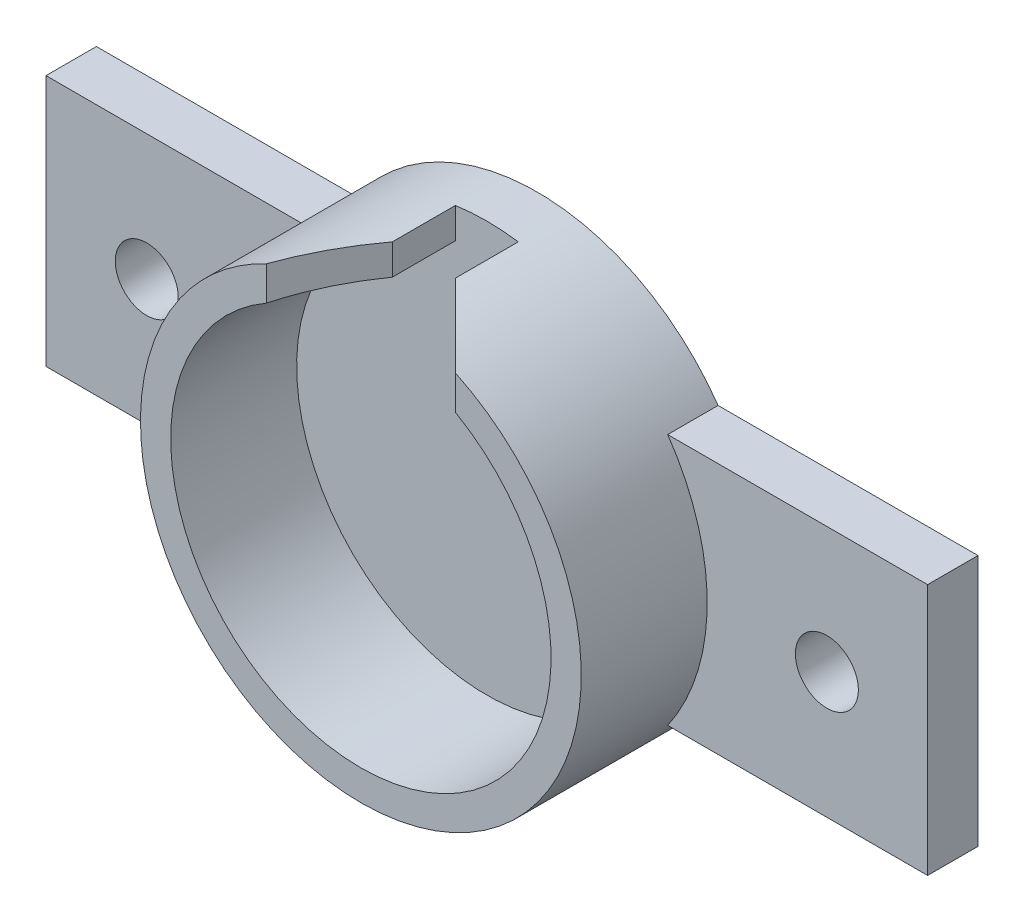
ISO-10303-21;
HEADER;
FILE_DESCRIPTION(('STEP AP214'),'2;1');
FILE_NAME('part.step','',(''),(''),'','','');
FILE_SCHEMA(('AUTOMOTIVE_DESIGN { 1 0 10303 214 1 1 1 1 }'));
ENDSEC;
DATA;
#1=APPLICATION_CONTEXT('core data for automotive mechanical design processes');
#2=APPLICATION_PROTOCOL_DEFINITION('international standard','automotive_design',2000,#1);
#3=PRODUCT_CONTEXT('',#1,'mechanical');
#4=PRODUCT('Part','Part','',(#3));
#5=PRODUCT_RELATED_PRODUCT_CATEGORY('part','',(#4));
#6=PRODUCT_DEFINITION_FORMATION('','',#4);
#7=PRODUCT_DEFINITION_CONTEXT('part definition',#1,'design');
#8=PRODUCT_DEFINITION('design','',#6,#7);
#9=PRODUCT_DEFINITION_SHAPE('','',#8);
#10=(LENGTH_UNIT() NAMED_UNIT(*) SI_UNIT(.MILLI.,.METRE.));
#11=(NAMED_UNIT(*) PLANE_ANGLE_UNIT() SI_UNIT($,.RADIAN.));
#12=(NAMED_UNIT(*) SI_UNIT($,.STERADIAN.) SOLID_ANGLE_UNIT());
#13=UNCERTAINTY_MEASURE_WITH_UNIT(LENGTH_MEASURE(1.E-05),#10,'distance_accuracy_value','');
#14=(GEOMETRIC_REPRESENTATION_CONTEXT(3) GLOBAL_UNCERTAINTY_ASSIGNED_CONTEXT((#13)) GLOBAL_UNIT_ASSIGNED_CONTEXT((#10,
#11,#12)) REPRESENTATION_CONTEXT('',''));
#15=CARTESIAN_POINT('',(0.,0.,0.));
#16=DIRECTION('',(0.,0.,1.));
#17=DIRECTION('',(1.,0.,0.));
#18=AXIS2_PLACEMENT_3D('',#15,#16,#17);
#19=CARTESIAN_POINT('',(0.,0.,10.));
#20=DIRECTION('',(0.,0.,1.));
#21=DIRECTION('',(1.,0.,0.));
#22=AXIS2_PLACEMENT_3D('',#19,#20,#21);
#23=PLANE('',#22);
#24=CARTESIAN_POINT('',(0.,0.,10.));
#25=DIRECTION('',(0.,0.,1.));
#26=DIRECTION('',(1.,0.,0.));
#27=AXIS2_PLACEMENT_3D('',#24,#25,#26);
#28=CIRCLE('',#27,15.1);
#29=CARTESIAN_POINT('',(-7.50000000000004,13.1057239403247,10.));
#30=VERTEX_POINT('',#29);
#31=CARTESIAN_POINT('',(7.50000000000004,13.1057239403247,10.));
#32=VERTEX_POINT('',#31);
#33=EDGE_CURVE('E280',#30,#32,#28,.T.);
#34=ORIENTED_EDGE('',*,*,#33,.F.);
#35=DIRECTION('',(0.,1.,0.));
#36=VECTOR('',#35,1.);
#37=CARTESIAN_POINT('',(-7.50000000000004,17.3205080756888,10.));
#38=LINE('',#37,#36);
#39=CARTESIAN_POINT('',(-7.50000000000004,15.8113883008419,10.));
#40=VERTEX_POINT('',#39);
#41=EDGE_CURVE('E306',#30,#40,#38,.T.);
#42=ORIENTED_EDGE('',*,*,#41,.T.);
#43=CARTESIAN_POINT('',(0.,0.,10.));
#44=DIRECTION('',(0.,0.,1.));
#45=DIRECTION('',(1.,0.,0.));
#46=AXIS2_PLACEMENT_3D('',#43,#44,#45);
#47=CIRCLE('',#46,17.5);
#48=CARTESIAN_POINT('',(7.50000000000004,15.8113883008419,10.));
#49=VERTEX_POINT('',#48);
#50=EDGE_CURVE('E287',#40,#49,#47,.T.);
#51=ORIENTED_EDGE('',*,*,#50,.T.);
#52=DIRECTION('',(0.,-1.,0.));
#53=VECTOR('',#52,1.);
#54=CARTESIAN_POINT('',(7.50000000000004,14.891608375189,10.));
#55=LINE('',#54,#53);
#56=EDGE_CURVE('E303',#49,#32,#55,.T.);
#57=ORIENTED_EDGE('',*,*,#56,.T.);
#58=EDGE_LOOP('',(#34,#42,#51,#57));
#59=FACE_BOUND('',#58,.T.);
#60=ADVANCED_FACE('F45',(#59),#23,.T.);
#61=CARTESIAN_POINT('',(0.,0.,10.));
#62=DIRECTION('',(0.,0.,-1.));
#63=DIRECTION('',(-1.,0.,0.));
#64=AXIS2_PLACEMENT_3D('',#61,#62,#63);
#65=CYLINDRICAL_SURFACE('',#64,17.5);
#66=ORIENTED_EDGE('',*,*,#50,.F.);
#67=CARTESIAN_POINT('',(0.,0.,2.49999999999989));
#68=DIRECTION('',(0.707106781186551,0.,0.707106781186544));
#69=DIRECTION('',(0.707106781186544,0.,-0.707106781186551));
#70=AXIS2_PLACEMENT_3D('',#67,#68,#69);
#71=ELLIPSE('',#70,24.7487373415293,17.5);
#72=CARTESIAN_POINT('',(-2.5,17.3205080756888,4.99999999999991));
#73=VERTEX_POINT('',#72);
#74=EDGE_CURVE('E55',#40,#73,#71,.F.);
#75=ORIENTED_EDGE('',*,*,#74,.T.);
#76=DIRECTION('',(0.,0.,-1.));
#77=VECTOR('',#76,1.);
#78=CARTESIAN_POINT('',(-2.5,17.3205080756888,10.));
#79=LINE('',#78,#77);
#80=CARTESIAN_POINT('',(-2.5,17.3205080756888,0.));
#81=VERTEX_POINT('',#80);
#82=EDGE_CURVE('E147',#73,#81,#79,.T.);
#83=ORIENTED_EDGE('',*,*,#82,.T.);
#84=CARTESIAN_POINT('',(0.,0.,0.));
#85=DIRECTION('',(0.,0.,1.));
#86=DIRECTION('',(1.,0.,0.));
#87=AXIS2_PLACEMENT_3D('',#84,#85,#86);
#88=CIRCLE('',#87,17.5);
#89=CARTESIAN_POINT('',(2.5,17.3205080756888,0.));
#90=VERTEX_POINT('',#89);
#91=EDGE_CURVE('E151',#90,#81,#88,.T.);
#92=ORIENTED_EDGE('',*,*,#91,.F.);
#93=DIRECTION('',(0.,0.,-1.));
#94=VECTOR('',#93,1.);
#95=CARTESIAN_POINT('',(2.5,17.3205080756888,10.));
#96=LINE('',#95,#94);
#97=CARTESIAN_POINT('',(2.5,17.3205080756888,4.99999999999991));
#98=VERTEX_POINT('',#97);
#99=EDGE_CURVE('E171',#90,#98,#96,.F.);
#100=ORIENTED_EDGE('',*,*,#99,.T.);
#101=CARTESIAN_POINT('',(0.,0.,2.49999999999988));
#102=DIRECTION('',(-0.707106781186551,0.,0.707106781186544));
#103=DIRECTION('',(-0.707106781186544,0.,-0.707106781186551));
#104=AXIS2_PLACEMENT_3D('',#101,#102,#103);
#105=ELLIPSE('',#104,24.7487373415293,17.5);
#106=EDGE_CURVE('E62',#98,#49,#105,.F.);
#107=ORIENTED_EDGE('',*,*,#106,.T.);
#108=EDGE_LOOP('',(#66,#75,#83,#92,#100,#107));
#109=FACE_BOUND('',#108,.T.);
#110=CARTESIAN_POINT('',(0.,0.,0.));
#111=DIRECTION('',(0.,0.,1.));
#112=DIRECTION('',(1.,0.,0.));
#113=AXIS2_PLACEMENT_3D('',#110,#111,#112);
#114=CIRCLE('',#113,17.5);
#115=CARTESIAN_POINT('',(14.3614066163451,-10.,0.));
#116=VERTEX_POINT('',#115);
#117=CARTESIAN_POINT('',(14.3614066163451,10.,0.));
#118=VERTEX_POINT('',#117);
#119=EDGE_CURVE('E284',#116,#118,#114,.T.);
#120=ORIENTED_EDGE('',*,*,#119,.T.);
#121=DIRECTION('',(0.,0.,1.));
#122=VECTOR('',#121,1.);
#123=CARTESIAN_POINT('',(14.3614066163451,10.,-4.));
#124=LINE('',#123,#122);
#125=CARTESIAN_POINT('',(14.3614066163451,10.,-4.));
#126=VERTEX_POINT('',#125);
#127=EDGE_CURVE('E263',#126,#118,#124,.T.);
#128=ORIENTED_EDGE('',*,*,#127,.F.);
#129=CARTESIAN_POINT('',(0.,0.,-4.));
#130=DIRECTION('',(0.,0.,-1.));
#131=DIRECTION('',(-1.,0.,0.));
#132=AXIS2_PLACEMENT_3D('',#129,#130,#131);
#133=CIRCLE('',#132,17.5);
#134=CARTESIAN_POINT('',(-14.3614066163451,10.,-4.));
#135=VERTEX_POINT('',#134);
#136=EDGE_CURVE('E214',#135,#126,#133,.T.);
#137=ORIENTED_EDGE('',*,*,#136,.F.);
#138=DIRECTION('',(0.,0.,1.));
#139=VECTOR('',#138,1.);
#140=CARTESIAN_POINT('',(-14.3614066163451,10.,-4.));
#141=LINE('',#140,#139);
#142=CARTESIAN_POINT('',(-14.3614066163451,10.,0.));
#143=VERTEX_POINT('',#142);
#144=EDGE_CURVE('E267',#135,#143,#141,.T.);
#145=ORIENTED_EDGE('',*,*,#144,.T.);
#146=CARTESIAN_POINT('',(-14.3614066163451,-10.,0.));
#147=VERTEX_POINT('',#146);
#148=EDGE_CURVE('E291',#143,#147,#114,.T.);
#149=ORIENTED_EDGE('',*,*,#148,.T.);
#150=DIRECTION('',(0.,0.,1.));
#151=VECTOR('',#150,1.);
#152=CARTESIAN_POINT('',(-14.3614066163451,-10.,-4.));
#153=LINE('',#152,#151);
#154=CARTESIAN_POINT('',(-14.3614066163451,-10.,-4.));
#155=VERTEX_POINT('',#154);
#156=EDGE_CURVE('E229',#155,#147,#153,.T.);
#157=ORIENTED_EDGE('',*,*,#156,.F.);
#158=CARTESIAN_POINT('',(0.,0.,-4.));
#159=DIRECTION('',(0.,0.,-1.));
#160=DIRECTION('',(-1.,0.,0.));
#161=AXIS2_PLACEMENT_3D('',#158,#159,#160);
#162=CIRCLE('',#161,17.5);
#163=CARTESIAN_POINT('',(14.3614066163451,-10.,-4.));
#164=VERTEX_POINT('',#163);
#165=EDGE_CURVE('E226',#164,#155,#162,.T.);
#166=ORIENTED_EDGE('',*,*,#165,.F.);
#167=DIRECTION('',(0.,0.,1.));
#168=VECTOR('',#167,1.);
#169=CARTESIAN_POINT('',(14.3614066163451,-10.,-4.));
#170=LINE('',#169,#168);
#171=EDGE_CURVE('E251',#164,#116,#170,.T.);
#172=ORIENTED_EDGE('',*,*,#171,.T.);
#173=EDGE_LOOP('',(#120,#128,#137,#145,#149,#157,#166,#172));
#174=FACE_BOUND('',#173,.T.);
#175=ADVANCED_FACE('F149',(#109,#174),#65,.T.);
#176=CARTESIAN_POINT('',(0.,0.,10.));
#177=DIRECTION('',(0.,0.,-1.));
#178=DIRECTION('',(-1.,0.,0.));
#179=AXIS2_PLACEMENT_3D('',#176,#177,#178);
#180=CYLINDRICAL_SURFACE('',#179,15.1);
#181=DIRECTION('',(0.,0.,-1.));
#182=VECTOR('',#181,1.);
#183=CARTESIAN_POINT('',(-2.5,14.891608375189,10.));
#184=LINE('',#183,#182);
#185=CARTESIAN_POINT('',(-2.5,14.891608375189,4.99999999999991));
#186=VERTEX_POINT('',#185);
#187=CARTESIAN_POINT('',(-2.5,14.891608375189,0.));
#188=VERTEX_POINT('',#187);
#189=EDGE_CURVE('E159',#186,#188,#184,.T.);
#190=ORIENTED_EDGE('',*,*,#189,.F.);
#191=CARTESIAN_POINT('',(0.,0.,2.49999999999989));
#192=DIRECTION('',(0.707106781186551,0.,0.707106781186544));
#193=DIRECTION('',(0.707106781186544,0.,-0.707106781186551));
#194=AXIS2_PLACEMENT_3D('',#191,#192,#193);
#195=ELLIPSE('',#194,21.3546247918338,15.1);
#196=EDGE_CURVE('E300',#186,#30,#195,.T.);
#197=ORIENTED_EDGE('',*,*,#196,.T.);
#198=ORIENTED_EDGE('',*,*,#33,.T.);
#199=CARTESIAN_POINT('',(0.,0.,2.49999999999988));
#200=DIRECTION('',(-0.707106781186551,0.,0.707106781186544));
#201=DIRECTION('',(-0.707106781186544,0.,-0.707106781186551));
#202=AXIS2_PLACEMENT_3D('',#199,#200,#201);
#203=ELLIPSE('',#202,21.3546247918338,15.1);
#204=CARTESIAN_POINT('',(2.5,14.891608375189,4.99999999999991));
#205=VERTEX_POINT('',#204);
#206=EDGE_CURVE('E297',#32,#205,#203,.T.);
#207=ORIENTED_EDGE('',*,*,#206,.T.);
#208=DIRECTION('',(0.,0.,-1.));
#209=VECTOR('',#208,1.);
#210=CARTESIAN_POINT('',(2.5,14.891608375189,10.));
#211=LINE('',#210,#209);
#212=CARTESIAN_POINT('',(2.5,14.891608375189,0.));
#213=VERTEX_POINT('',#212);
#214=EDGE_CURVE('E158',#213,#205,#211,.F.);
#215=ORIENTED_EDGE('',*,*,#214,.F.);
#216=CARTESIAN_POINT('',(0.,0.,0.));
#217=DIRECTION('',(0.,0.,1.));
#218=DIRECTION('',(1.,0.,0.));
#219=AXIS2_PLACEMENT_3D('',#216,#217,#218);
#220=CIRCLE('',#219,15.1);
#221=EDGE_CURVE('E279',#188,#213,#220,.T.);
#222=ORIENTED_EDGE('',*,*,#221,.F.);
#223=EDGE_LOOP('',(#190,#197,#198,#207,#215,#222));
#224=FACE_BOUND('',#223,.T.);
#225=ADVANCED_FACE('F364',(#224),#180,.F.);
#226=CARTESIAN_POINT('',(0.,0.,0.));
#227=DIRECTION('',(0.,0.,-1.));
#228=DIRECTION('',(-1.,0.,0.));
#229=AXIS2_PLACEMENT_3D('',#226,#227,#228);
#230=PLANE('',#229);
#231=ORIENTED_EDGE('',*,*,#221,.T.);
#232=DIRECTION('',(0.,1.,0.));
#233=VECTOR('',#232,1.);
#234=CARTESIAN_POINT('',(2.5,19.1,0.));
#235=LINE('',#234,#233);
#236=EDGE_CURVE('E168',#213,#90,#235,.T.);
#237=ORIENTED_EDGE('',*,*,#236,.T.);
#238=ORIENTED_EDGE('',*,*,#91,.T.);
#239=DIRECTION('',(0.,-1.,0.));
#240=VECTOR('',#239,1.);
#241=CARTESIAN_POINT('',(-2.5,19.1,0.));
#242=LINE('',#241,#240);
#243=EDGE_CURVE('E166',#81,#188,#242,.T.);
#244=ORIENTED_EDGE('',*,*,#243,.T.);
#245=EDGE_LOOP('',(#231,#237,#238,#244));
#246=FACE_BOUND('',#245,.T.);
#247=ADVANCED_FACE('F165',(#246),#230,.F.);
#248=CARTESIAN_POINT('',(-27.,0.,0.));
#249=DIRECTION('',(0.,0.,1.));
#250=DIRECTION('',(1.,0.,0.));
#251=AXIS2_PLACEMENT_3D('',#248,#249,#250);
#252=CIRCLE('',#251,2.5);
#253=CARTESIAN_POINT('',(-24.5,0.,0.));
#254=VERTEX_POINT('',#253);
#255=EDGE_CURVE('E192',#254,#254,#252,.T.);
#256=ORIENTED_EDGE('',*,*,#255,.F.);
#257=EDGE_LOOP('',(#256));
#258=FACE_BOUND('',#257,.T.);
#259=ORIENTED_EDGE('',*,*,#148,.F.);
#260=DIRECTION('',(1.,0.,0.));
#261=VECTOR('',#260,1.);
#262=CARTESIAN_POINT('',(-14.3614066163451,10.,0.));
#263=LINE('',#262,#261);
#264=CARTESIAN_POINT('',(-35.,10.,0.));
#265=VERTEX_POINT('',#264);
#266=EDGE_CURVE('E236',#265,#143,#263,.T.);
#267=ORIENTED_EDGE('',*,*,#266,.F.);
#268=DIRECTION('',(0.,1.,0.));
#269=VECTOR('',#268,1.);
#270=CARTESIAN_POINT('',(-35.,10.,0.));
#271=LINE('',#270,#269);
#272=CARTESIAN_POINT('',(-35.,-10.,0.));
#273=VERTEX_POINT('',#272);
#274=EDGE_CURVE('E233',#273,#265,#271,.T.);
#275=ORIENTED_EDGE('',*,*,#274,.F.);
#276=DIRECTION('',(-1.,0.,0.));
#277=VECTOR('',#276,1.);
#278=CARTESIAN_POINT('',(-14.3614066163451,-10.,0.));
#279=LINE('',#278,#277);
#280=EDGE_CURVE('E191',#147,#273,#279,.T.);
#281=ORIENTED_EDGE('',*,*,#280,.F.);
#282=EDGE_LOOP('',(#259,#267,#275,#281));
#283=FACE_BOUND('',#282,.T.);
#284=ADVANCED_FACE('F321',(#258,#283),#230,.F.);
#285=CARTESIAN_POINT('',(-14.3614066163451,-10.,-4.));
#286=DIRECTION('',(0.,1.,0.));
#287=DIRECTION('',(0.,0.,1.));
#288=AXIS2_PLACEMENT_3D('',#285,#286,#287);
#289=PLANE('',#288);
#290=ORIENTED_EDGE('',*,*,#280,.T.);
#291=DIRECTION('',(0.,0.,1.));
#292=VECTOR('',#291,1.);
#293=CARTESIAN_POINT('',(-35.,-10.,-4.));
#294=LINE('',#293,#292);
#295=CARTESIAN_POINT('',(-35.,-10.,-4.));
#296=VERTEX_POINT('',#295);
#297=EDGE_CURVE('E275',#296,#273,#294,.T.);
#298=ORIENTED_EDGE('',*,*,#297,.F.);
#299=DIRECTION('',(-1.,0.,0.));
#300=VECTOR('',#299,1.);
#301=CARTESIAN_POINT('',(-14.3614066163451,-10.,-4.));
#302=LINE('',#301,#300);
#303=EDGE_CURVE('E203',#155,#296,#302,.T.);
#304=ORIENTED_EDGE('',*,*,#303,.F.);
#305=ORIENTED_EDGE('',*,*,#156,.T.);
#306=EDGE_LOOP('',(#290,#298,#304,#305));
#307=FACE_BOUND('',#306,.T.);
#308=ADVANCED_FACE('F330',(#307),#289,.F.);
#309=CARTESIAN_POINT('',(-35.,10.,-4.));
#310=DIRECTION('',(1.,0.,0.));
#311=DIRECTION('',(0.,0.,-1.));
#312=AXIS2_PLACEMENT_3D('',#309,#310,#311);
#313=PLANE('',#312);
#314=ORIENTED_EDGE('',*,*,#274,.T.);
#315=DIRECTION('',(0.,0.,1.));
#316=VECTOR('',#315,1.);
#317=CARTESIAN_POINT('',(-35.,10.,-4.));
#318=LINE('',#317,#316);
#319=CARTESIAN_POINT('',(-35.,10.,-4.));
#320=VERTEX_POINT('',#319);
#321=EDGE_CURVE('E271',#320,#265,#318,.T.);
#322=ORIENTED_EDGE('',*,*,#321,.F.);
#323=DIRECTION('',(0.,1.,0.));
#324=VECTOR('',#323,1.);
#325=CARTESIAN_POINT('',(-35.,10.,-4.));
#326=LINE('',#325,#324);
#327=EDGE_CURVE('E207',#296,#320,#326,.T.);
#328=ORIENTED_EDGE('',*,*,#327,.F.);
#329=ORIENTED_EDGE('',*,*,#297,.T.);
#330=EDGE_LOOP('',(#314,#322,#328,#329));
#331=FACE_BOUND('',#330,.T.);
#332=ADVANCED_FACE('F327',(#331),#313,.F.);
#333=CARTESIAN_POINT('',(-14.3614066163451,10.,-4.));
#334=DIRECTION('',(0.,-1.,0.));
#335=DIRECTION('',(0.,0.,-1.));
#336=AXIS2_PLACEMENT_3D('',#333,#334,#335);
#337=PLANE('',#336);
#338=ORIENTED_EDGE('',*,*,#266,.T.);
#339=ORIENTED_EDGE('',*,*,#144,.F.);
#340=DIRECTION('',(1.,0.,0.));
#341=VECTOR('',#340,1.);
#342=CARTESIAN_POINT('',(-14.3614066163451,10.,-4.));
#343=LINE('',#342,#341);
#344=EDGE_CURVE('E211',#320,#135,#343,.T.);
#345=ORIENTED_EDGE('',*,*,#344,.F.);
#346=ORIENTED_EDGE('',*,*,#321,.T.);
#347=EDGE_LOOP('',(#338,#339,#345,#346));
#348=FACE_BOUND('',#347,.T.);
#349=ADVANCED_FACE('F323',(#348),#337,.F.);
#350=CARTESIAN_POINT('',(35.,10.,-4.));
#351=DIRECTION('',(0.,-1.,0.));
#352=DIRECTION('',(0.,0.,-1.));
#353=AXIS2_PLACEMENT_3D('',#350,#351,#352);
#354=PLANE('',#353);
#355=DIRECTION('',(1.,0.,0.));
#356=VECTOR('',#355,1.);
#357=CARTESIAN_POINT('',(35.,10.,0.));
#358=LINE('',#357,#356);
#359=CARTESIAN_POINT('',(35.,10.,0.));
#360=VERTEX_POINT('',#359);
#361=EDGE_CURVE('E240',#118,#360,#358,.T.);
#362=ORIENTED_EDGE('',*,*,#361,.T.);
#363=DIRECTION('',(0.,0.,1.));
#364=VECTOR('',#363,1.);
#365=CARTESIAN_POINT('',(35.,10.,-4.));
#366=LINE('',#365,#364);
#367=CARTESIAN_POINT('',(35.,10.,-4.));
#368=VERTEX_POINT('',#367);
#369=EDGE_CURVE('E259',#368,#360,#366,.T.);
#370=ORIENTED_EDGE('',*,*,#369,.F.);
#371=DIRECTION('',(1.,0.,0.));
#372=VECTOR('',#371,1.);
#373=CARTESIAN_POINT('',(35.,10.,-4.));
#374=LINE('',#373,#372);
#375=EDGE_CURVE('E217',#126,#368,#374,.T.);
#376=ORIENTED_EDGE('',*,*,#375,.F.);
#377=ORIENTED_EDGE('',*,*,#127,.T.);
#378=EDGE_LOOP('',(#362,#370,#376,#377));
#379=FACE_BOUND('',#378,.T.);
#380=ADVANCED_FACE('F346',(#379),#354,.F.);
#381=CARTESIAN_POINT('',(35.,10.,-4.));
#382=DIRECTION('',(-1.,0.,0.));
#383=DIRECTION('',(0.,0.,1.));
#384=AXIS2_PLACEMENT_3D('',#381,#382,#383);
#385=PLANE('',#384);
#386=DIRECTION('',(0.,-1.,0.));
#387=VECTOR('',#386,1.);
#388=CARTESIAN_POINT('',(35.,10.,0.));
#389=LINE('',#388,#387);
#390=CARTESIAN_POINT('',(35.,-10.,0.));
#391=VERTEX_POINT('',#390);
#392=EDGE_CURVE('E243',#360,#391,#389,.T.);
#393=ORIENTED_EDGE('',*,*,#392,.T.);
#394=DIRECTION('',(0.,0.,1.));
#395=VECTOR('',#394,1.);
#396=CARTESIAN_POINT('',(35.,-10.,-4.));
#397=LINE('',#396,#395);
#398=CARTESIAN_POINT('',(35.,-10.,-4.));
#399=VERTEX_POINT('',#398);
#400=EDGE_CURVE('E255',#399,#391,#397,.T.);
#401=ORIENTED_EDGE('',*,*,#400,.F.);
#402=DIRECTION('',(0.,-1.,0.));
#403=VECTOR('',#402,1.);
#404=CARTESIAN_POINT('',(35.,10.,-4.));
#405=LINE('',#404,#403);
#406=EDGE_CURVE('E220',#368,#399,#405,.T.);
#407=ORIENTED_EDGE('',*,*,#406,.F.);
#408=ORIENTED_EDGE('',*,*,#369,.T.);
#409=EDGE_LOOP('',(#393,#401,#407,#408));
#410=FACE_BOUND('',#409,.T.);
#411=ADVANCED_FACE('F349',(#410),#385,.F.);
#412=CARTESIAN_POINT('',(35.,-10.,-4.));
#413=DIRECTION('',(0.,1.,0.));
#414=DIRECTION('',(0.,0.,1.));
#415=AXIS2_PLACEMENT_3D('',#412,#413,#414);
#416=PLANE('',#415);
#417=DIRECTION('',(-1.,0.,0.));
#418=VECTOR('',#417,1.);
#419=CARTESIAN_POINT('',(35.,-10.,0.));
#420=LINE('',#419,#418);
#421=EDGE_CURVE('E208',#391,#116,#420,.T.);
#422=ORIENTED_EDGE('',*,*,#421,.T.);
#423=ORIENTED_EDGE('',*,*,#171,.F.);
#424=DIRECTION('',(-1.,0.,0.));
#425=VECTOR('',#424,1.);
#426=CARTESIAN_POINT('',(35.,-10.,-4.));
#427=LINE('',#426,#425);
#428=EDGE_CURVE('E223',#399,#164,#427,.T.);
#429=ORIENTED_EDGE('',*,*,#428,.F.);
#430=ORIENTED_EDGE('',*,*,#400,.T.);
#431=EDGE_LOOP('',(#422,#423,#429,#430));
#432=FACE_BOUND('',#431,.T.);
#433=ADVANCED_FACE('F337',(#432),#416,.F.);
#434=CARTESIAN_POINT('',(0.,0.,-4.));
#435=DIRECTION('',(0.,0.,-1.));
#436=DIRECTION('',(-1.,0.,0.));
#437=AXIS2_PLACEMENT_3D('',#434,#435,#436);
#438=PLANE('',#437);
#439=CARTESIAN_POINT('',(-27.,0.,-4.));
#440=DIRECTION('',(0.,0.,1.));
#441=DIRECTION('',(1.,0.,0.));
#442=AXIS2_PLACEMENT_3D('',#439,#440,#441);
#443=CIRCLE('',#442,2.5);
#444=CARTESIAN_POINT('',(-24.5,0.,-4.));
#445=VERTEX_POINT('',#444);
#446=EDGE_CURVE('E187',#445,#445,#443,.T.);
#447=ORIENTED_EDGE('',*,*,#446,.T.);
#448=EDGE_LOOP('',(#447));
#449=FACE_BOUND('',#448,.T.);
#450=CARTESIAN_POINT('',(27.,0.,-4.));
#451=DIRECTION('',(0.,0.,1.));
#452=DIRECTION('',(-1.,0.,0.));
#453=AXIS2_PLACEMENT_3D('',#450,#451,#452);
#454=CIRCLE('',#453,2.5);
#455=CARTESIAN_POINT('',(24.5,0.,-4.));
#456=VERTEX_POINT('',#455);
#457=EDGE_CURVE('E196',#456,#456,#454,.T.);
#458=ORIENTED_EDGE('',*,*,#457,.T.);
#459=EDGE_LOOP('',(#458));
#460=FACE_BOUND('',#459,.T.);
#461=ORIENTED_EDGE('',*,*,#303,.T.);
#462=ORIENTED_EDGE('',*,*,#327,.T.);
#463=ORIENTED_EDGE('',*,*,#344,.T.);
#464=ORIENTED_EDGE('',*,*,#136,.T.);
#465=ORIENTED_EDGE('',*,*,#375,.T.);
#466=ORIENTED_EDGE('',*,*,#406,.T.);
#467=ORIENTED_EDGE('',*,*,#428,.T.);
#468=ORIENTED_EDGE('',*,*,#165,.T.);
#469=EDGE_LOOP('',(#461,#462,#463,#464,#465,#466,#467,#468));
#470=FACE_BOUND('',#469,.T.);
#471=ADVANCED_FACE('F332',(#449,#460,#470),#438,.T.);
#472=CARTESIAN_POINT('',(27.,0.,0.));
#473=DIRECTION('',(0.,0.,1.));
#474=DIRECTION('',(-1.,0.,0.));
#475=AXIS2_PLACEMENT_3D('',#472,#473,#474);
#476=CIRCLE('',#475,2.5);
#477=CARTESIAN_POINT('',(24.5,0.,0.));
#478=VERTEX_POINT('',#477);
#479=EDGE_CURVE('E170',#478,#478,#476,.T.);
#480=ORIENTED_EDGE('',*,*,#479,.F.);
#481=EDGE_LOOP('',(#480));
#482=FACE_BOUND('',#481,.T.);
#483=ORIENTED_EDGE('',*,*,#119,.F.);
#484=ORIENTED_EDGE('',*,*,#421,.F.);
#485=ORIENTED_EDGE('',*,*,#392,.F.);
#486=ORIENTED_EDGE('',*,*,#361,.F.);
#487=EDGE_LOOP('',(#483,#484,#485,#486));
#488=FACE_BOUND('',#487,.T.);
#489=ADVANCED_FACE('F342',(#482,#488),#230,.F.);
#490=CARTESIAN_POINT('',(27.,0.,-4.));
#491=DIRECTION('',(0.,0.,1.));
#492=DIRECTION('',(1.,0.,0.));
#493=AXIS2_PLACEMENT_3D('',#490,#491,#492);
#494=CYLINDRICAL_SURFACE('',#493,2.5);
#495=ORIENTED_EDGE('',*,*,#457,.F.);
#496=EDGE_LOOP('',(#495));
#497=FACE_BOUND('',#496,.T.);
#498=ORIENTED_EDGE('',*,*,#479,.T.);
#499=EDGE_LOOP('',(#498));
#500=FACE_BOUND('',#499,.T.);
#501=ADVANCED_FACE('F392',(#497,#500),#494,.F.);
#502=CARTESIAN_POINT('',(-27.,0.,-4.));
#503=DIRECTION('',(0.,0.,1.));
#504=DIRECTION('',(1.,0.,0.));
#505=AXIS2_PLACEMENT_3D('',#502,#503,#504);
#506=CYLINDRICAL_SURFACE('',#505,2.5);
#507=ORIENTED_EDGE('',*,*,#446,.F.);
#508=EDGE_LOOP('',(#507));
#509=FACE_BOUND('',#508,.T.);
#510=ORIENTED_EDGE('',*,*,#255,.T.);
#511=EDGE_LOOP('',(#510));
#512=FACE_BOUND('',#511,.T.);
#513=ADVANCED_FACE('F387',(#509,#512),#506,.F.);
#514=CARTESIAN_POINT('',(2.5,19.1,0.));
#515=DIRECTION('',(1.,0.,0.));
#516=DIRECTION('',(0.,1.,0.));
#517=AXIS2_PLACEMENT_3D('',#514,#515,#516);
#518=PLANE('',#517);
#519=ORIENTED_EDGE('',*,*,#214,.T.);
#520=DIRECTION('',(0.,1.,0.));
#521=VECTOR('',#520,1.);
#522=CARTESIAN_POINT('',(2.5,17.3205080756888,4.99999999999991));
#523=LINE('',#522,#521);
#524=EDGE_CURVE('E11',#205,#98,#523,.T.);
#525=ORIENTED_EDGE('',*,*,#524,.T.);
#526=ORIENTED_EDGE('',*,*,#99,.F.);
#527=ORIENTED_EDGE('',*,*,#236,.F.);
#528=EDGE_LOOP('',(#519,#525,#526,#527));
#529=FACE_BOUND('',#528,.T.);
#530=ADVANCED_FACE('F379',(#529),#518,.F.);
#531=CARTESIAN_POINT('',(-2.5,19.1,0.));
#532=DIRECTION('',(-1.,0.,0.));
#533=DIRECTION('',(0.,-1.,0.));
#534=AXIS2_PLACEMENT_3D('',#531,#532,#533);
#535=PLANE('',#534);
#536=ORIENTED_EDGE('',*,*,#82,.F.);
#537=DIRECTION('',(0.,-1.,0.));
#538=VECTOR('',#537,1.);
#539=CARTESIAN_POINT('',(-2.5,14.891608375189,4.99999999999991));
#540=LINE('',#539,#538);
#541=EDGE_CURVE('E290',#73,#186,#540,.T.);
#542=ORIENTED_EDGE('',*,*,#541,.T.);
#543=ORIENTED_EDGE('',*,*,#189,.T.);
#544=ORIENTED_EDGE('',*,*,#243,.F.);
#545=EDGE_LOOP('',(#536,#542,#543,#544));
#546=FACE_BOUND('',#545,.T.);
#547=ADVANCED_FACE('F173',(#546),#535,.F.);
#548=CARTESIAN_POINT('',(-2.5,19.1,4.99999999999991));
#549=DIRECTION('',(0.707106781186551,0.,0.707106781186544));
#550=DIRECTION('',(0.,1.,0.));
#551=AXIS2_PLACEMENT_3D('',#548,#549,#550);
#552=PLANE('',#551);
#553=ORIENTED_EDGE('',*,*,#74,.F.);
#554=ORIENTED_EDGE('',*,*,#41,.F.);
#555=ORIENTED_EDGE('',*,*,#196,.F.);
#556=ORIENTED_EDGE('',*,*,#541,.F.);
#557=EDGE_LOOP('',(#553,#554,#555,#556));
#558=FACE_BOUND('',#557,.T.);
#559=ADVANCED_FACE('F370',(#558),#552,.T.);
#560=CARTESIAN_POINT('',(2.5,19.1,4.99999999999991));
#561=DIRECTION('',(-0.707106781186551,0.,0.707106781186544));
#562=DIRECTION('',(0.,-1.,0.));
#563=AXIS2_PLACEMENT_3D('',#560,#561,#562);
#564=PLANE('',#563);
#565=ORIENTED_EDGE('',*,*,#206,.F.);
#566=ORIENTED_EDGE('',*,*,#56,.F.);
#567=ORIENTED_EDGE('',*,*,#106,.F.);
#568=ORIENTED_EDGE('',*,*,#524,.F.);
#569=EDGE_LOOP('',(#565,#566,#567,#568));
#570=FACE_BOUND('',#569,.T.);
#571=ADVANCED_FACE('F48',(#570),#564,.T.);
#572=CLOSED_SHELL('',(#60,#175,#225,#247,#284,#308,#332,#349,#380,#411,#433,#471,#489,#501,#513,
#530,#547,#559,#571));
#573=MANIFOLD_SOLID_BREP('B2',#572);
#574=ADVANCED_BREP_SHAPE_REPRESENTATION('',(#18,#573),#14);
#575=SHAPE_DEFINITION_REPRESENTATION(#9,#574);
ENDSEC;
END-ISO-10303-21;
